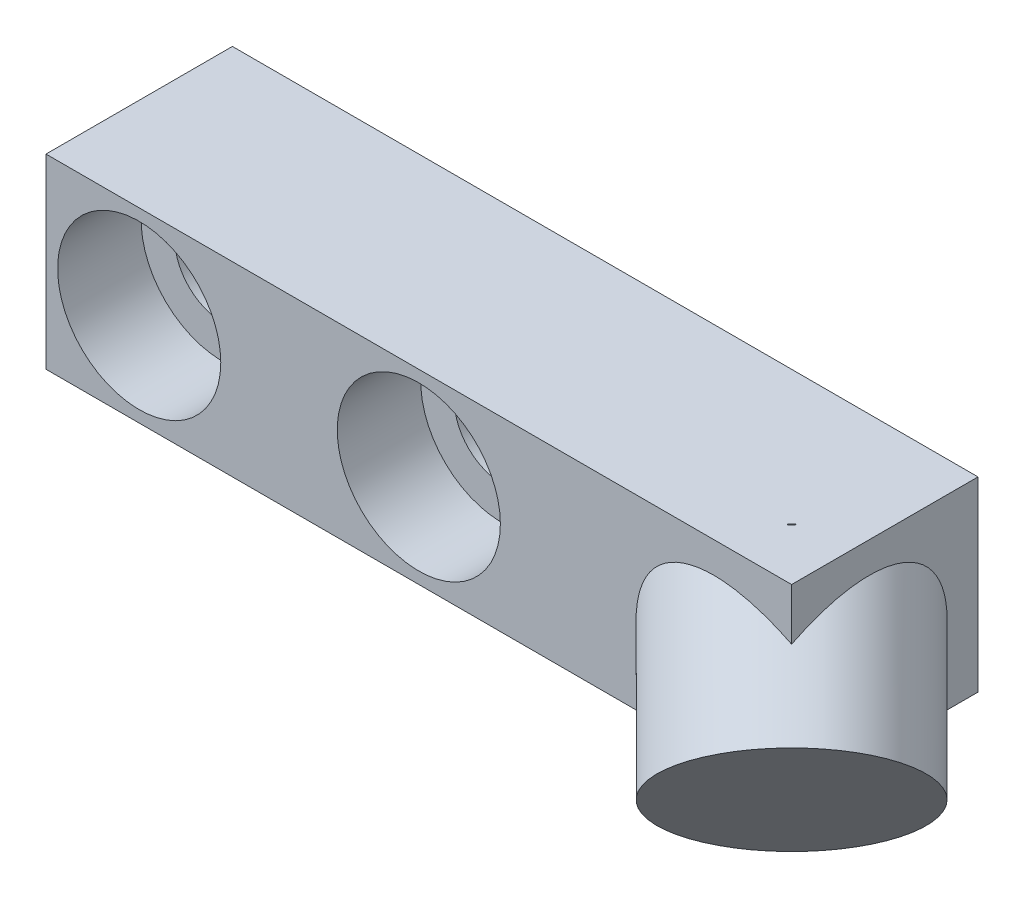
ISO-10303-21;
HEADER;
FILE_DESCRIPTION(('STEP AP214'),'2;1');
FILE_NAME('part.step','',(''),(''),'','','');
FILE_SCHEMA(('AUTOMOTIVE_DESIGN { 1 0 10303 214 1 1 1 1 }'));
ENDSEC;
DATA;
#1=APPLICATION_CONTEXT('core data for automotive mechanical design processes');
#2=APPLICATION_PROTOCOL_DEFINITION('international standard','automotive_design',2000,#1);
#3=PRODUCT_CONTEXT('',#1,'mechanical');
#4=PRODUCT('Part','Part','',(#3));
#5=PRODUCT_RELATED_PRODUCT_CATEGORY('part','',(#4));
#6=PRODUCT_DEFINITION_FORMATION('','',#4);
#7=PRODUCT_DEFINITION_CONTEXT('part definition',#1,'design');
#8=PRODUCT_DEFINITION('design','',#6,#7);
#9=PRODUCT_DEFINITION_SHAPE('','',#8);
#10=(LENGTH_UNIT() NAMED_UNIT(*) SI_UNIT(.MILLI.,.METRE.));
#11=(NAMED_UNIT(*) PLANE_ANGLE_UNIT() SI_UNIT($,.RADIAN.));
#12=(NAMED_UNIT(*) SI_UNIT($,.STERADIAN.) SOLID_ANGLE_UNIT());
#13=UNCERTAINTY_MEASURE_WITH_UNIT(LENGTH_MEASURE(1.E-05),#10,'distance_accuracy_value','');
#14=(GEOMETRIC_REPRESENTATION_CONTEXT(3) GLOBAL_UNCERTAINTY_ASSIGNED_CONTEXT((#13)) GLOBAL_UNIT_ASSIGNED_CONTEXT((#10,
#11,#12)) REPRESENTATION_CONTEXT('',''));
#15=CARTESIAN_POINT('',(0.,0.,0.));
#16=DIRECTION('',(0.,0.,1.));
#17=DIRECTION('',(1.,0.,0.));
#18=AXIS2_PLACEMENT_3D('',#15,#16,#17);
#19=CARTESIAN_POINT('',(-12.7,-3.175,6.35));
#20=DIRECTION('',(-1.,0.,0.));
#21=DIRECTION('',(0.,0.,1.));
#22=AXIS2_PLACEMENT_3D('',#19,#20,#21);
#23=PLANE('',#22);
#24=DIRECTION('',(0.,1.,0.));
#25=VECTOR('',#24,1.);
#26=CARTESIAN_POINT('',(-12.7,-3.175,0.));
#27=LINE('',#26,#25);
#28=CARTESIAN_POINT('',(-12.7,-3.175,0.));
#29=VERTEX_POINT('',#28);
#30=CARTESIAN_POINT('',(-12.7,3.175,0.));
#31=VERTEX_POINT('',#30);
#32=EDGE_CURVE('E144',#29,#31,#27,.T.);
#33=ORIENTED_EDGE('',*,*,#32,.F.);
#34=DIRECTION('',(0.,0.,-1.));
#35=VECTOR('',#34,1.);
#36=CARTESIAN_POINT('',(-12.7,-3.175,6.35));
#37=LINE('',#36,#35);
#38=CARTESIAN_POINT('',(-12.7,-3.175,6.35));
#39=VERTEX_POINT('',#38);
#40=EDGE_CURVE('E155',#39,#29,#37,.T.);
#41=ORIENTED_EDGE('',*,*,#40,.F.);
#42=DIRECTION('',(0.,1.,0.));
#43=VECTOR('',#42,1.);
#44=CARTESIAN_POINT('',(-12.7,-3.175,6.35));
#45=LINE('',#44,#43);
#46=CARTESIAN_POINT('',(-12.7,3.175,6.35));
#47=VERTEX_POINT('',#46);
#48=EDGE_CURVE('E131',#39,#47,#45,.T.);
#49=ORIENTED_EDGE('',*,*,#48,.T.);
#50=DIRECTION('',(0.,0.,-1.));
#51=VECTOR('',#50,1.);
#52=CARTESIAN_POINT('',(-12.7,3.175,6.35));
#53=LINE('',#52,#51);
#54=EDGE_CURVE('E143',#47,#31,#53,.T.);
#55=ORIENTED_EDGE('',*,*,#54,.T.);
#56=EDGE_LOOP('',(#33,#41,#49,#55));
#57=FACE_BOUND('',#56,.T.);
#58=ADVANCED_FACE('F33',(#57),#23,.T.);
#59=CARTESIAN_POINT('',(-12.7,-3.175,6.35));
#60=DIRECTION('',(0.,1.,0.));
#61=DIRECTION('',(0.,0.,1.));
#62=AXIS2_PLACEMENT_3D('',#59,#60,#61);
#63=PLANE('',#62);
#64=DIRECTION('',(0.,0.,-1.));
#65=VECTOR('',#64,1.);
#66=CARTESIAN_POINT('',(12.7,-3.175,6.35));
#67=LINE('',#66,#65);
#68=CARTESIAN_POINT('',(12.7,-3.175,1.76149333933141));
#69=VERTEX_POINT('',#68);
#70=CARTESIAN_POINT('',(12.7,-3.175,0.));
#71=VERTEX_POINT('',#70);
#72=EDGE_CURVE('E157',#69,#71,#67,.T.);
#73=ORIENTED_EDGE('',*,*,#72,.F.);
#74=CARTESIAN_POINT('',(12.7,-3.175,6.35));
#75=DIRECTION('',(0.,1.,0.));
#76=DIRECTION('',(0.707106781186548,0.,0.707106781186547));
#77=AXIS2_PLACEMENT_3D('',#74,#75,#76);
#78=ELLIPSE('',#77,6.4891283505568,3.7465);
#79=CARTESIAN_POINT('',(8.11149333933141,-3.175,6.35));
#80=VERTEX_POINT('',#79);
#81=EDGE_CURVE('E106',#69,#80,#78,.T.);
#82=ORIENTED_EDGE('',*,*,#81,.T.);
#83=DIRECTION('',(1.,0.,0.));
#84=VECTOR('',#83,1.);
#85=CARTESIAN_POINT('',(-12.7,-3.175,6.35));
#86=LINE('',#85,#84);
#87=EDGE_CURVE('E140',#39,#80,#86,.T.);
#88=ORIENTED_EDGE('',*,*,#87,.F.);
#89=ORIENTED_EDGE('',*,*,#40,.T.);
#90=DIRECTION('',(1.,0.,0.));
#91=VECTOR('',#90,1.);
#92=CARTESIAN_POINT('',(-12.7,-3.175,0.));
#93=LINE('',#92,#91);
#94=EDGE_CURVE('E135',#29,#71,#93,.T.);
#95=ORIENTED_EDGE('',*,*,#94,.T.);
#96=EDGE_LOOP('',(#73,#82,#88,#89,#95));
#97=FACE_BOUND('',#96,.T.);
#98=ADVANCED_FACE('F185',(#97),#63,.F.);
#99=CARTESIAN_POINT('',(12.7,-3.175,6.35));
#100=DIRECTION('',(-1.,0.,0.));
#101=DIRECTION('',(0.,0.,1.));
#102=AXIS2_PLACEMENT_3D('',#99,#100,#101);
#103=PLANE('',#102);
#104=DIRECTION('',(0.,1.,0.));
#105=VECTOR('',#104,1.);
#106=CARTESIAN_POINT('',(12.7,-3.175,6.35));
#107=LINE('',#106,#105);
#108=CARTESIAN_POINT('',(12.7,1.41350666066859,6.35));
#109=VERTEX_POINT('',#108);
#110=CARTESIAN_POINT('',(12.7,3.175,6.35));
#111=VERTEX_POINT('',#110);
#112=EDGE_CURVE('E138',#109,#111,#107,.T.);
#113=ORIENTED_EDGE('',*,*,#112,.F.);
#114=CARTESIAN_POINT('',(12.7,-3.175,6.35));
#115=DIRECTION('',(-1.,0.,0.));
#116=DIRECTION('',(0.,-0.707106781186548,0.707106781186548));
#117=AXIS2_PLACEMENT_3D('',#114,#115,#116);
#118=ELLIPSE('',#117,6.4891283505568,3.7465);
#119=EDGE_CURVE('E54',#109,#69,#118,.T.);
#120=ORIENTED_EDGE('',*,*,#119,.T.);
#121=ORIENTED_EDGE('',*,*,#72,.T.);
#122=DIRECTION('',(0.,1.,0.));
#123=VECTOR('',#122,1.);
#124=CARTESIAN_POINT('',(12.7,-3.175,0.));
#125=LINE('',#124,#123);
#126=CARTESIAN_POINT('',(12.7,3.175,0.));
#127=VERTEX_POINT('',#126);
#128=EDGE_CURVE('E150',#71,#127,#125,.T.);
#129=ORIENTED_EDGE('',*,*,#128,.T.);
#130=DIRECTION('',(0.,0.,-1.));
#131=VECTOR('',#130,1.);
#132=CARTESIAN_POINT('',(12.7,3.175,6.35));
#133=LINE('',#132,#131);
#134=EDGE_CURVE('E159',#111,#127,#133,.T.);
#135=ORIENTED_EDGE('',*,*,#134,.F.);
#136=EDGE_LOOP('',(#113,#120,#121,#129,#135));
#137=FACE_BOUND('',#136,.T.);
#138=ADVANCED_FACE('F182',(#137),#103,.F.);
#139=CARTESIAN_POINT('',(-12.7,3.175,6.35));
#140=DIRECTION('',(0.,1.,0.));
#141=DIRECTION('',(0.,0.,1.));
#142=AXIS2_PLACEMENT_3D('',#139,#140,#141);
#143=PLANE('',#142);
#144=CARTESIAN_POINT('',(6.35,3.175,0.));
#145=DIRECTION('',(0.,1.,0.));
#146=DIRECTION('',(0.707106781186548,0.,0.707106781186547));
#147=AXIS2_PLACEMENT_3D('',#144,#145,#146);
#148=ELLIPSE('',#147,6.4891283505568,3.7465);
#149=CARTESIAN_POINT('',(10.7276035018956,3.175,4.77372613284826));
#150=VERTEX_POINT('',#149);
#151=CARTESIAN_POINT('',(11.1237261328483,3.175,4.37760350189561));
#152=VERTEX_POINT('',#151);
#153=EDGE_CURVE('E100',#150,#152,#148,.T.);
#154=ORIENTED_EDGE('',*,*,#153,.F.);
#155=DIRECTION('',(0.707106781186547,0.,-0.707106781186548));
#156=VECTOR('',#155,1.);
#157=CARTESIAN_POINT('',(-1.77433518262806,3.175,17.2756648173719));
#158=LINE('',#157,#156);
#159=EDGE_CURVE('E92',#150,#152,#158,.T.);
#160=ORIENTED_EDGE('',*,*,#159,.T.);
#161=EDGE_LOOP('',(#154,#160));
#162=FACE_BOUND('',#161,.T.);
#163=DIRECTION('',(1.,0.,0.));
#164=VECTOR('',#163,1.);
#165=CARTESIAN_POINT('',(-12.7,3.175,0.));
#166=LINE('',#165,#164);
#167=EDGE_CURVE('E147',#31,#127,#166,.T.);
#168=ORIENTED_EDGE('',*,*,#167,.F.);
#169=ORIENTED_EDGE('',*,*,#54,.F.);
#170=DIRECTION('',(1.,0.,0.));
#171=VECTOR('',#170,1.);
#172=CARTESIAN_POINT('',(-12.7,3.175,6.35));
#173=LINE('',#172,#171);
#174=EDGE_CURVE('E134',#47,#111,#173,.T.);
#175=ORIENTED_EDGE('',*,*,#174,.T.);
#176=ORIENTED_EDGE('',*,*,#134,.T.);
#177=EDGE_LOOP('',(#168,#169,#175,#176));
#178=FACE_BOUND('',#177,.T.);
#179=ADVANCED_FACE('F103',(#162,#178),#143,.T.);
#180=CARTESIAN_POINT('',(0.,0.,6.35));
#181=DIRECTION('',(0.,0.,-1.));
#182=DIRECTION('',(-1.,0.,0.));
#183=AXIS2_PLACEMENT_3D('',#180,#181,#182);
#184=PLANE('',#183);
#185=CARTESIAN_POINT('',(-9.525,0.,6.35));
#186=DIRECTION('',(0.,0.,1.));
#187=DIRECTION('',(1.,0.,0.));
#188=AXIS2_PLACEMENT_3D('',#185,#186,#187);
#189=CIRCLE('',#188,2.77875999999999);
#190=CARTESIAN_POINT('',(-6.74624000000001,0.,6.35));
#191=VERTEX_POINT('',#190);
#192=EDGE_CURVE('E105',#191,#191,#189,.T.);
#193=ORIENTED_EDGE('',*,*,#192,.F.);
#194=EDGE_LOOP('',(#193));
#195=FACE_BOUND('',#194,.T.);
#196=CARTESIAN_POINT('',(0.,0.,6.35));
#197=DIRECTION('',(0.,0.,1.));
#198=DIRECTION('',(1.,0.,0.));
#199=AXIS2_PLACEMENT_3D('',#196,#197,#198);
#200=CIRCLE('',#199,2.77875999999999);
#201=CARTESIAN_POINT('',(2.77875999999999,0.,6.35));
#202=VERTEX_POINT('',#201);
#203=EDGE_CURVE('E121',#202,#202,#200,.T.);
#204=ORIENTED_EDGE('',*,*,#203,.F.);
#205=EDGE_LOOP('',(#204));
#206=FACE_BOUND('',#205,.T.);
#207=ORIENTED_EDGE('',*,*,#87,.T.);
#208=CARTESIAN_POINT('',(12.7,-3.175,6.35));
#209=DIRECTION('',(0.,0.,-1.));
#210=DIRECTION('',(0.707106781186548,-0.707106781186547,0.));
#211=AXIS2_PLACEMENT_3D('',#208,#209,#210);
#212=ELLIPSE('',#211,6.4891283505568,3.7465);
#213=EDGE_CURVE('E96',#80,#109,#212,.T.);
#214=ORIENTED_EDGE('',*,*,#213,.T.);
#215=ORIENTED_EDGE('',*,*,#112,.T.);
#216=ORIENTED_EDGE('',*,*,#174,.F.);
#217=ORIENTED_EDGE('',*,*,#48,.F.);
#218=EDGE_LOOP('',(#207,#214,#215,#216,#217));
#219=FACE_BOUND('',#218,.T.);
#220=ADVANCED_FACE('F195',(#195,#206,#219),#184,.F.);
#221=CARTESIAN_POINT('',(0.,0.,0.));
#222=DIRECTION('',(0.,0.,-1.));
#223=DIRECTION('',(-1.,0.,0.));
#224=AXIS2_PLACEMENT_3D('',#221,#222,#223);
#225=PLANE('',#224);
#226=CARTESIAN_POINT('',(6.35,3.175,0.));
#227=DIRECTION('',(0.,0.,-1.));
#228=DIRECTION('',(0.707106781186548,-0.707106781186547,0.));
#229=AXIS2_PLACEMENT_3D('',#226,#227,#228);
#230=ELLIPSE('',#229,6.4891283505568,3.7465);
#231=CARTESIAN_POINT('',(11.1237261328483,-1.20260350189558,0.));
#232=VERTEX_POINT('',#231);
#233=CARTESIAN_POINT('',(10.7276035018956,-1.59872613284828,0.));
#234=VERTEX_POINT('',#233);
#235=EDGE_CURVE('E11',#232,#234,#230,.T.);
#236=ORIENTED_EDGE('',*,*,#235,.F.);
#237=DIRECTION('',(-0.707106781186547,-0.707106781186548,0.));
#238=VECTOR('',#237,1.);
#239=CARTESIAN_POINT('',(6.16316481737193,-6.16316481737193,0.));
#240=LINE('',#239,#238);
#241=EDGE_CURVE('E40',#232,#234,#240,.T.);
#242=ORIENTED_EDGE('',*,*,#241,.T.);
#243=EDGE_LOOP('',(#236,#242));
#244=FACE_BOUND('',#243,.T.);
#245=CARTESIAN_POINT('',(-9.525,0.,0.));
#246=DIRECTION('',(0.,0.,-1.));
#247=DIRECTION('',(-1.,0.,0.));
#248=AXIS2_PLACEMENT_3D('',#245,#246,#247);
#249=CIRCLE('',#248,1.63195);
#250=CARTESIAN_POINT('',(-11.15695,0.,0.));
#251=VERTEX_POINT('',#250);
#252=EDGE_CURVE('E120',#251,#251,#249,.T.);
#253=ORIENTED_EDGE('',*,*,#252,.F.);
#254=EDGE_LOOP('',(#253));
#255=FACE_BOUND('',#254,.T.);
#256=CARTESIAN_POINT('',(0.,0.,0.));
#257=DIRECTION('',(0.,0.,-1.));
#258=DIRECTION('',(-1.,0.,0.));
#259=AXIS2_PLACEMENT_3D('',#256,#257,#258);
#260=CIRCLE('',#259,1.63195);
#261=CARTESIAN_POINT('',(-1.63195,0.,0.));
#262=VERTEX_POINT('',#261);
#263=EDGE_CURVE('E130',#262,#262,#260,.T.);
#264=ORIENTED_EDGE('',*,*,#263,.F.);
#265=EDGE_LOOP('',(#264));
#266=FACE_BOUND('',#265,.T.);
#267=ORIENTED_EDGE('',*,*,#32,.T.);
#268=ORIENTED_EDGE('',*,*,#167,.T.);
#269=ORIENTED_EDGE('',*,*,#128,.F.);
#270=ORIENTED_EDGE('',*,*,#94,.F.);
#271=EDGE_LOOP('',(#267,#268,#269,#270));
#272=FACE_BOUND('',#271,.T.);
#273=ADVANCED_FACE('F168',(#244,#255,#266,#272),#225,.T.);
#274=CARTESIAN_POINT('',(0.,0.,6.35));
#275=DIRECTION('',(0.,0.,1.));
#276=DIRECTION('',(1.,0.,0.));
#277=AXIS2_PLACEMENT_3D('',#274,#275,#276);
#278=CYLINDRICAL_SURFACE('',#277,1.63195);
#279=ORIENTED_EDGE('',*,*,#263,.T.);
#280=EDGE_LOOP('',(#279));
#281=FACE_BOUND('',#280,.T.);
#282=CARTESIAN_POINT('',(0.,0.,3.5052));
#283=DIRECTION('',(0.,0.,1.));
#284=DIRECTION('',(1.,0.,0.));
#285=AXIS2_PLACEMENT_3D('',#282,#283,#284);
#286=CIRCLE('',#285,1.63195);
#287=CARTESIAN_POINT('',(1.63195,0.,3.5052));
#288=VERTEX_POINT('',#287);
#289=EDGE_CURVE('E127',#288,#288,#286,.T.);
#290=ORIENTED_EDGE('',*,*,#289,.T.);
#291=EDGE_LOOP('',(#290));
#292=FACE_BOUND('',#291,.T.);
#293=ADVANCED_FACE('F230',(#281,#292),#278,.F.);
#294=CARTESIAN_POINT('',(1.63195,0.,3.5052));
#295=DIRECTION('',(0.,0.,-1.));
#296=DIRECTION('',(-1.,0.,0.));
#297=AXIS2_PLACEMENT_3D('',#294,#295,#296);
#298=PLANE('',#297);
#299=ORIENTED_EDGE('',*,*,#289,.F.);
#300=EDGE_LOOP('',(#299));
#301=FACE_BOUND('',#300,.T.);
#302=CARTESIAN_POINT('',(0.,0.,3.5052));
#303=DIRECTION('',(0.,0.,1.));
#304=DIRECTION('',(1.,0.,0.));
#305=AXIS2_PLACEMENT_3D('',#302,#303,#304);
#306=CIRCLE('',#305,2.77876);
#307=CARTESIAN_POINT('',(2.77875999999999,0.,3.5052));
#308=VERTEX_POINT('',#307);
#309=EDGE_CURVE('E124',#308,#308,#306,.T.);
#310=ORIENTED_EDGE('',*,*,#309,.T.);
#311=EDGE_LOOP('',(#310));
#312=FACE_BOUND('',#311,.T.);
#313=ADVANCED_FACE('F236',(#301,#312),#298,.F.);
#314=CARTESIAN_POINT('',(0.,0.,6.35));
#315=DIRECTION('',(0.,0.,1.));
#316=DIRECTION('',(1.,0.,0.));
#317=AXIS2_PLACEMENT_3D('',#314,#315,#316);
#318=CYLINDRICAL_SURFACE('',#317,2.77876);
#319=ORIENTED_EDGE('',*,*,#309,.F.);
#320=EDGE_LOOP('',(#319));
#321=FACE_BOUND('',#320,.T.);
#322=ORIENTED_EDGE('',*,*,#203,.T.);
#323=EDGE_LOOP('',(#322));
#324=FACE_BOUND('',#323,.T.);
#325=ADVANCED_FACE('F240',(#321,#324),#318,.F.);
#326=CARTESIAN_POINT('',(-9.525,0.,6.35));
#327=DIRECTION('',(0.,0.,1.));
#328=DIRECTION('',(1.,0.,0.));
#329=AXIS2_PLACEMENT_3D('',#326,#327,#328);
#330=CYLINDRICAL_SURFACE('',#329,1.63195);
#331=ORIENTED_EDGE('',*,*,#252,.T.);
#332=EDGE_LOOP('',(#331));
#333=FACE_BOUND('',#332,.T.);
#334=CARTESIAN_POINT('',(-9.525,0.,3.5052));
#335=DIRECTION('',(0.,0.,1.));
#336=DIRECTION('',(1.,0.,0.));
#337=AXIS2_PLACEMENT_3D('',#334,#335,#336);
#338=CIRCLE('',#337,1.63195);
#339=CARTESIAN_POINT('',(-7.89305,0.,3.5052));
#340=VERTEX_POINT('',#339);
#341=EDGE_CURVE('E117',#340,#340,#338,.T.);
#342=ORIENTED_EDGE('',*,*,#341,.T.);
#343=EDGE_LOOP('',(#342));
#344=FACE_BOUND('',#343,.T.);
#345=ADVANCED_FACE('F244',(#333,#344),#330,.F.);
#346=CARTESIAN_POINT('',(-7.89305,0.,3.5052));
#347=DIRECTION('',(0.,0.,-1.));
#348=DIRECTION('',(-1.,0.,0.));
#349=AXIS2_PLACEMENT_3D('',#346,#347,#348);
#350=PLANE('',#349);
#351=ORIENTED_EDGE('',*,*,#341,.F.);
#352=EDGE_LOOP('',(#351));
#353=FACE_BOUND('',#352,.T.);
#354=CARTESIAN_POINT('',(-9.525,0.,3.5052));
#355=DIRECTION('',(0.,0.,1.));
#356=DIRECTION('',(1.,0.,0.));
#357=AXIS2_PLACEMENT_3D('',#354,#355,#356);
#358=CIRCLE('',#357,2.77876);
#359=CARTESIAN_POINT('',(-6.74624000000001,0.,3.5052));
#360=VERTEX_POINT('',#359);
#361=EDGE_CURVE('E109',#360,#360,#358,.T.);
#362=ORIENTED_EDGE('',*,*,#361,.T.);
#363=EDGE_LOOP('',(#362));
#364=FACE_BOUND('',#363,.T.);
#365=ADVANCED_FACE('F248',(#353,#364),#350,.F.);
#366=CARTESIAN_POINT('',(-9.525,0.,6.35));
#367=DIRECTION('',(0.,0.,1.));
#368=DIRECTION('',(1.,0.,0.));
#369=AXIS2_PLACEMENT_3D('',#366,#367,#368);
#370=CYLINDRICAL_SURFACE('',#369,2.77876);
#371=ORIENTED_EDGE('',*,*,#361,.F.);
#372=EDGE_LOOP('',(#371));
#373=FACE_BOUND('',#372,.T.);
#374=ORIENTED_EDGE('',*,*,#192,.T.);
#375=EDGE_LOOP('',(#374));
#376=FACE_BOUND('',#375,.T.);
#377=ADVANCED_FACE('F251',(#373,#376),#370,.F.);
#378=CARTESIAN_POINT('',(9.40044321158129,0.124556788418711,3.05044321158129));
#379=DIRECTION('',(0.577350269189626,-0.577350269189626,0.577350269189626));
#380=DIRECTION('',(0.707106781186547,0.,-0.707106781186548));
#381=AXIS2_PLACEMENT_3D('',#378,#379,#380);
#382=PLANE('',#381);
#383=ORIENTED_EDGE('',*,*,#241,.F.);
#384=CARTESIAN_POINT('',(9.40044321158129,0.124556788418711,3.05044321158129));
#385=DIRECTION('',(0.577350269189626,-0.577350269189626,0.577350269189626));
#386=DIRECTION('',(0.707106781186547,0.,-0.707106781186548));
#387=AXIS2_PLACEMENT_3D('',#384,#385,#386);
#388=CIRCLE('',#387,3.7465);
#389=EDGE_CURVE('E101',#234,#232,#388,.T.);
#390=ORIENTED_EDGE('',*,*,#389,.F.);
#391=EDGE_LOOP('',(#383,#390));
#392=FACE_BOUND('',#391,.T.);
#393=ADVANCED_FACE('F172',(#392),#382,.F.);
#394=CARTESIAN_POINT('',(9.40044321158129,0.124556788418711,3.05044321158129));
#395=DIRECTION('',(0.577350269189626,-0.577350269189626,0.577350269189626));
#396=DIRECTION('',(0.707106781186547,0.,-0.707106781186548));
#397=AXIS2_PLACEMENT_3D('',#394,#395,#396);
#398=CYLINDRICAL_SURFACE('',#397,3.7465);
#399=ORIENTED_EDGE('',*,*,#389,.T.);
#400=ORIENTED_EDGE('',*,*,#235,.T.);
#401=EDGE_LOOP('',(#399,#400));
#402=FACE_BOUND('',#401,.T.);
#403=ADVANCED_FACE('F174',(#402),#398,.T.);
#404=CARTESIAN_POINT('',(12.7,-3.175,6.35));
#405=DIRECTION('',(0.577350269189626,-0.577350269189626,0.577350269189626));
#406=DIRECTION('',(0.707106781186547,0.,-0.707106781186548));
#407=AXIS2_PLACEMENT_3D('',#404,#405,#406);
#408=PLANE('',#407);
#409=CARTESIAN_POINT('',(12.7,-3.175,6.35));
#410=VERTEX_POINT('',#409);
#411=VERTEX_LOOP('',#410);
#412=FACE_BOUND('',#411,.T.);
#413=CARTESIAN_POINT('',(12.7,-3.175,6.35));
#414=DIRECTION('',(0.577350269189626,-0.577350269189626,0.577350269189626));
#415=DIRECTION('',(0.707106781186547,0.,-0.707106781186548));
#416=AXIS2_PLACEMENT_3D('',#413,#414,#415);
#417=CIRCLE('',#416,3.7465);
#418=CARTESIAN_POINT('',(15.3491755557154,-3.175,3.7008244442846));
#419=VERTEX_POINT('',#418);
#420=EDGE_CURVE('E175',#419,#419,#417,.T.);
#421=ORIENTED_EDGE('',*,*,#420,.T.);
#422=EDGE_LOOP('',(#421));
#423=FACE_BOUND('',#422,.T.);
#424=ADVANCED_FACE('F199',(#412,#423),#408,.T.);
#425=ORIENTED_EDGE('',*,*,#420,.F.);
#426=EDGE_LOOP('',(#425));
#427=FACE_BOUND('',#426,.T.);
#428=ORIENTED_EDGE('',*,*,#81,.F.);
#429=ORIENTED_EDGE('',*,*,#119,.F.);
#430=ORIENTED_EDGE('',*,*,#213,.F.);
#431=EDGE_LOOP('',(#428,#429,#430));
#432=FACE_BOUND('',#431,.T.);
#433=ADVANCED_FACE('F197',(#427,#432),#398,.T.);
#434=EDGE_CURVE('E46',#152,#150,#388,.T.);
#435=ORIENTED_EDGE('',*,*,#434,.T.);
#436=ORIENTED_EDGE('',*,*,#153,.T.);
#437=EDGE_LOOP('',(#435,#436));
#438=FACE_BOUND('',#437,.T.);
#439=ADVANCED_FACE('F99',(#438),#398,.T.);
#440=ORIENTED_EDGE('',*,*,#159,.F.);
#441=ORIENTED_EDGE('',*,*,#434,.F.);
#442=EDGE_LOOP('',(#440,#441));
#443=FACE_BOUND('',#442,.T.);
#444=ADVANCED_FACE('F93',(#443),#382,.F.);
#445=CLOSED_SHELL('',(#58,#98,#138,#179,#220,#273,#293,#313,#325,#345,#365,#377,#393,#403,#424,
#433,#439,#444));
#446=MANIFOLD_SOLID_BREP('B2',#445);
#447=ADVANCED_BREP_SHAPE_REPRESENTATION('',(#18,#446),#14);
#448=SHAPE_DEFINITION_REPRESENTATION(#9,#447);
ENDSEC;
END-ISO-10303-21;
